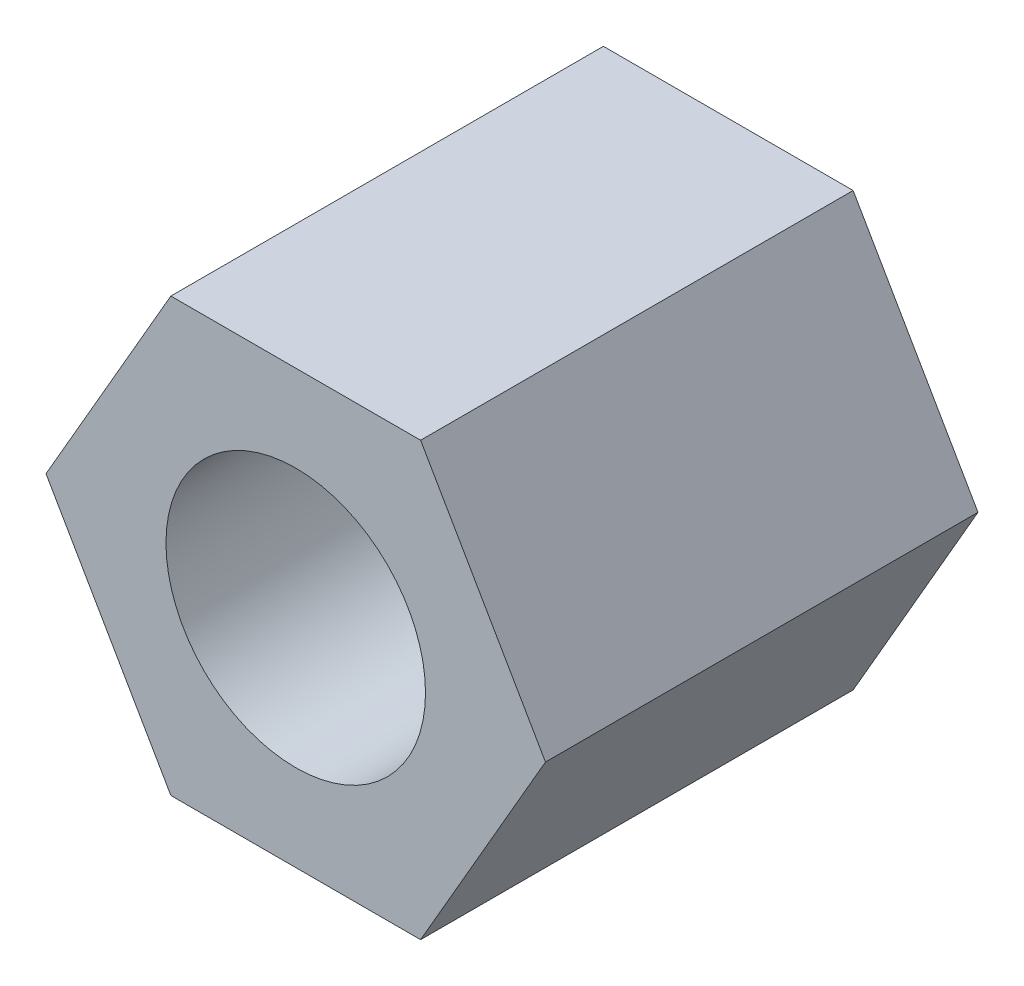
ISO-10303-21;
HEADER;
FILE_DESCRIPTION(('STEP AP214'),'2;1');
FILE_NAME('part.step','',(''),(''),'','','');
FILE_SCHEMA(('AUTOMOTIVE_DESIGN { 1 0 10303 214 1 1 1 1 }'));
ENDSEC;
DATA;
#1=APPLICATION_CONTEXT('core data for automotive mechanical design processes');
#2=APPLICATION_PROTOCOL_DEFINITION('international standard','automotive_design',2000,#1);
#3=PRODUCT_CONTEXT('',#1,'mechanical');
#4=PRODUCT('Part','Part','',(#3));
#5=PRODUCT_RELATED_PRODUCT_CATEGORY('part','',(#4));
#6=PRODUCT_DEFINITION_FORMATION('','',#4);
#7=PRODUCT_DEFINITION_CONTEXT('part definition',#1,'design');
#8=PRODUCT_DEFINITION('design','',#6,#7);
#9=PRODUCT_DEFINITION_SHAPE('','',#8);
#10=(LENGTH_UNIT() NAMED_UNIT(*) SI_UNIT(.MILLI.,.METRE.));
#11=(NAMED_UNIT(*) PLANE_ANGLE_UNIT() SI_UNIT($,.RADIAN.));
#12=(NAMED_UNIT(*) SI_UNIT($,.STERADIAN.) SOLID_ANGLE_UNIT());
#13=UNCERTAINTY_MEASURE_WITH_UNIT(LENGTH_MEASURE(1.E-05),#10,'distance_accuracy_value','');
#14=(GEOMETRIC_REPRESENTATION_CONTEXT(3) GLOBAL_UNCERTAINTY_ASSIGNED_CONTEXT((#13)) GLOBAL_UNIT_ASSIGNED_CONTEXT((#10,
#11,#12)) REPRESENTATION_CONTEXT('',''));
#15=CARTESIAN_POINT('',(0.,0.,0.));
#16=DIRECTION('',(0.,0.,1.));
#17=DIRECTION('',(1.,0.,0.));
#18=AXIS2_PLACEMENT_3D('',#15,#16,#17);
#19=CARTESIAN_POINT('',(0.,0.,5.));
#20=DIRECTION('',(0.,0.,1.));
#21=DIRECTION('',(1.,0.,0.));
#22=AXIS2_PLACEMENT_3D('',#19,#20,#21);
#23=PLANE('',#22);
#24=DIRECTION('',(1.,0.,0.));
#25=VECTOR('',#24,1.);
#26=CARTESIAN_POINT('',(-1.44337567297406,-2.5,5.));
#27=LINE('',#26,#25);
#28=CARTESIAN_POINT('',(-1.44337567297406,-2.5,5.));
#29=VERTEX_POINT('',#28);
#30=CARTESIAN_POINT('',(1.44337567297406,-2.5,5.));
#31=VERTEX_POINT('',#30);
#32=EDGE_CURVE('E131',#29,#31,#27,.T.);
#33=ORIENTED_EDGE('',*,*,#32,.T.);
#34=DIRECTION('',(0.5,0.866025403784439,0.));
#35=VECTOR('',#34,1.);
#36=CARTESIAN_POINT('',(1.44337567297406,-2.5,5.));
#37=LINE('',#36,#35);
#38=CARTESIAN_POINT('',(2.88675134594813,0.,5.));
#39=VERTEX_POINT('',#38);
#40=EDGE_CURVE('E89',#31,#39,#37,.T.);
#41=ORIENTED_EDGE('',*,*,#40,.T.);
#42=DIRECTION('',(-0.5,0.866025403784439,0.));
#43=VECTOR('',#42,1.);
#44=CARTESIAN_POINT('',(2.88675134594813,0.,5.));
#45=LINE('',#44,#43);
#46=CARTESIAN_POINT('',(1.44337567297406,2.5,5.));
#47=VERTEX_POINT('',#46);
#48=EDGE_CURVE('E102',#39,#47,#45,.T.);
#49=ORIENTED_EDGE('',*,*,#48,.T.);
#50=DIRECTION('',(-1.,0.,0.));
#51=VECTOR('',#50,1.);
#52=CARTESIAN_POINT('',(1.44337567297406,2.5,5.));
#53=LINE('',#52,#51);
#54=CARTESIAN_POINT('',(-1.44337567297406,2.5,5.));
#55=VERTEX_POINT('',#54);
#56=EDGE_CURVE('E96',#47,#55,#53,.T.);
#57=ORIENTED_EDGE('',*,*,#56,.T.);
#58=DIRECTION('',(-0.5,-0.866025403784439,0.));
#59=VECTOR('',#58,1.);
#60=CARTESIAN_POINT('',(-1.44337567297406,2.5,5.));
#61=LINE('',#60,#59);
#62=CARTESIAN_POINT('',(-2.88675134594813,0.,5.));
#63=VERTEX_POINT('',#62);
#64=EDGE_CURVE('E100',#55,#63,#61,.T.);
#65=ORIENTED_EDGE('',*,*,#64,.T.);
#66=DIRECTION('',(0.5,-0.866025403784439,0.));
#67=VECTOR('',#66,1.);
#68=CARTESIAN_POINT('',(-2.88675134594813,0.,5.));
#69=LINE('',#68,#67);
#70=EDGE_CURVE('E52',#63,#29,#69,.T.);
#71=ORIENTED_EDGE('',*,*,#70,.T.);
#72=EDGE_LOOP('',(#33,#41,#49,#57,#65,#71));
#73=FACE_BOUND('',#72,.T.);
#74=CARTESIAN_POINT('',(0.,0.,5.));
#75=DIRECTION('',(0.,0.,1.));
#76=DIRECTION('',(1.,0.,0.));
#77=AXIS2_PLACEMENT_3D('',#74,#75,#76);
#78=CIRCLE('',#77,1.5);
#79=CARTESIAN_POINT('',(1.5,0.,5.));
#80=VERTEX_POINT('',#79);
#81=EDGE_CURVE('E124',#80,#80,#78,.T.);
#82=ORIENTED_EDGE('',*,*,#81,.F.);
#83=EDGE_LOOP('',(#82));
#84=FACE_BOUND('',#83,.T.);
#85=ADVANCED_FACE('F35',(#73,#84),#23,.T.);
#86=CARTESIAN_POINT('',(0.,0.,0.));
#87=DIRECTION('',(0.,0.,1.));
#88=DIRECTION('',(1.,0.,0.));
#89=AXIS2_PLACEMENT_3D('',#86,#87,#88);
#90=PLANE('',#89);
#91=DIRECTION('',(1.,0.,0.));
#92=VECTOR('',#91,1.);
#93=CARTESIAN_POINT('',(-1.44337567297406,-2.5,0.));
#94=LINE('',#93,#92);
#95=CARTESIAN_POINT('',(-1.44337567297406,-2.5,0.));
#96=VERTEX_POINT('',#95);
#97=CARTESIAN_POINT('',(1.44337567297406,-2.5,0.));
#98=VERTEX_POINT('',#97);
#99=EDGE_CURVE('E120',#96,#98,#94,.T.);
#100=ORIENTED_EDGE('',*,*,#99,.F.);
#101=DIRECTION('',(0.5,-0.866025403784439,0.));
#102=VECTOR('',#101,1.);
#103=CARTESIAN_POINT('',(-2.88675134594813,0.,0.));
#104=LINE('',#103,#102);
#105=CARTESIAN_POINT('',(-2.88675134594813,0.,0.));
#106=VERTEX_POINT('',#105);
#107=EDGE_CURVE('E81',#106,#96,#104,.T.);
#108=ORIENTED_EDGE('',*,*,#107,.F.);
#109=DIRECTION('',(-0.5,-0.866025403784439,0.));
#110=VECTOR('',#109,1.);
#111=CARTESIAN_POINT('',(-1.44337567297406,2.5,0.));
#112=LINE('',#111,#110);
#113=CARTESIAN_POINT('',(-1.44337567297406,2.5,0.));
#114=VERTEX_POINT('',#113);
#115=EDGE_CURVE('E75',#114,#106,#112,.T.);
#116=ORIENTED_EDGE('',*,*,#115,.F.);
#117=DIRECTION('',(-1.,0.,0.));
#118=VECTOR('',#117,1.);
#119=CARTESIAN_POINT('',(1.44337567297406,2.5,0.));
#120=LINE('',#119,#118);
#121=CARTESIAN_POINT('',(1.44337567297406,2.5,0.));
#122=VERTEX_POINT('',#121);
#123=EDGE_CURVE('E110',#122,#114,#120,.T.);
#124=ORIENTED_EDGE('',*,*,#123,.F.);
#125=DIRECTION('',(-0.5,0.866025403784439,0.));
#126=VECTOR('',#125,1.);
#127=CARTESIAN_POINT('',(2.88675134594813,0.,0.));
#128=LINE('',#127,#126);
#129=CARTESIAN_POINT('',(2.88675134594813,0.,0.));
#130=VERTEX_POINT('',#129);
#131=EDGE_CURVE('E126',#130,#122,#128,.T.);
#132=ORIENTED_EDGE('',*,*,#131,.F.);
#133=DIRECTION('',(0.5,0.866025403784439,0.));
#134=VECTOR('',#133,1.);
#135=CARTESIAN_POINT('',(1.44337567297406,-2.5,0.));
#136=LINE('',#135,#134);
#137=EDGE_CURVE('E123',#98,#130,#136,.T.);
#138=ORIENTED_EDGE('',*,*,#137,.F.);
#139=EDGE_LOOP('',(#100,#108,#116,#124,#132,#138));
#140=FACE_BOUND('',#139,.T.);
#141=CARTESIAN_POINT('',(0.,0.,0.));
#142=DIRECTION('',(0.,0.,1.));
#143=DIRECTION('',(1.,0.,0.));
#144=AXIS2_PLACEMENT_3D('',#141,#142,#143);
#145=CIRCLE('',#144,1.5);
#146=CARTESIAN_POINT('',(1.5,0.,0.));
#147=VERTEX_POINT('',#146);
#148=EDGE_CURVE('E224',#147,#147,#145,.T.);
#149=ORIENTED_EDGE('',*,*,#148,.T.);
#150=EDGE_LOOP('',(#149));
#151=FACE_BOUND('',#150,.T.);
#152=ADVANCED_FACE('F140',(#140,#151),#90,.F.);
#153=CARTESIAN_POINT('',(-1.44337567297406,-2.5,5.));
#154=DIRECTION('',(0.,1.,0.));
#155=DIRECTION('',(-1.,0.,0.));
#156=AXIS2_PLACEMENT_3D('',#153,#154,#155);
#157=PLANE('',#156);
#158=ORIENTED_EDGE('',*,*,#99,.T.);
#159=DIRECTION('',(0.,0.,-1.));
#160=VECTOR('',#159,1.);
#161=CARTESIAN_POINT('',(1.44337567297406,-2.5,5.));
#162=LINE('',#161,#160);
#163=EDGE_CURVE('E11',#31,#98,#162,.T.);
#164=ORIENTED_EDGE('',*,*,#163,.F.);
#165=ORIENTED_EDGE('',*,*,#32,.F.);
#166=DIRECTION('',(0.,0.,-1.));
#167=VECTOR('',#166,1.);
#168=CARTESIAN_POINT('',(-1.44337567297406,-2.5,5.));
#169=LINE('',#168,#167);
#170=EDGE_CURVE('E116',#29,#96,#169,.T.);
#171=ORIENTED_EDGE('',*,*,#170,.T.);
#172=EDGE_LOOP('',(#158,#164,#165,#171));
#173=FACE_BOUND('',#172,.T.);
#174=ADVANCED_FACE('F37',(#173),#157,.F.);
#175=CARTESIAN_POINT('',(1.44337567297406,-2.5,5.));
#176=DIRECTION('',(-0.866025403784439,0.5,0.));
#177=DIRECTION('',(-0.5,-0.866025403784439,0.));
#178=AXIS2_PLACEMENT_3D('',#175,#176,#177);
#179=PLANE('',#178);
#180=ORIENTED_EDGE('',*,*,#137,.T.);
#181=DIRECTION('',(0.,0.,-1.));
#182=VECTOR('',#181,1.);
#183=CARTESIAN_POINT('',(2.88675134594813,0.,5.));
#184=LINE('',#183,#182);
#185=EDGE_CURVE('E44',#39,#130,#184,.T.);
#186=ORIENTED_EDGE('',*,*,#185,.F.);
#187=ORIENTED_EDGE('',*,*,#40,.F.);
#188=ORIENTED_EDGE('',*,*,#163,.T.);
#189=EDGE_LOOP('',(#180,#186,#187,#188));
#190=FACE_BOUND('',#189,.T.);
#191=ADVANCED_FACE('F165',(#190),#179,.F.);
#192=CARTESIAN_POINT('',(2.88675134594813,0.,5.));
#193=DIRECTION('',(-0.866025403784439,-0.5,0.));
#194=DIRECTION('',(0.5,-0.866025403784439,0.));
#195=AXIS2_PLACEMENT_3D('',#192,#193,#194);
#196=PLANE('',#195);
#197=ORIENTED_EDGE('',*,*,#131,.T.);
#198=DIRECTION('',(0.,0.,-1.));
#199=VECTOR('',#198,1.);
#200=CARTESIAN_POINT('',(1.44337567297406,2.5,5.));
#201=LINE('',#200,#199);
#202=EDGE_CURVE('E111',#47,#122,#201,.T.);
#203=ORIENTED_EDGE('',*,*,#202,.F.);
#204=ORIENTED_EDGE('',*,*,#48,.F.);
#205=ORIENTED_EDGE('',*,*,#185,.T.);
#206=EDGE_LOOP('',(#197,#203,#204,#205));
#207=FACE_BOUND('',#206,.T.);
#208=ADVANCED_FACE('F137',(#207),#196,.F.);
#209=CARTESIAN_POINT('',(1.44337567297406,2.5,5.));
#210=DIRECTION('',(0.,-1.,0.));
#211=DIRECTION('',(0.,0.,-1.));
#212=AXIS2_PLACEMENT_3D('',#209,#210,#211);
#213=PLANE('',#212);
#214=ORIENTED_EDGE('',*,*,#123,.T.);
#215=DIRECTION('',(0.,0.,-1.));
#216=VECTOR('',#215,1.);
#217=CARTESIAN_POINT('',(-1.44337567297406,2.5,5.));
#218=LINE('',#217,#216);
#219=EDGE_CURVE('E107',#55,#114,#218,.T.);
#220=ORIENTED_EDGE('',*,*,#219,.F.);
#221=ORIENTED_EDGE('',*,*,#56,.F.);
#222=ORIENTED_EDGE('',*,*,#202,.T.);
#223=EDGE_LOOP('',(#214,#220,#221,#222));
#224=FACE_BOUND('',#223,.T.);
#225=ADVANCED_FACE('F108',(#224),#213,.F.);
#226=CARTESIAN_POINT('',(-1.44337567297406,2.5,5.));
#227=DIRECTION('',(0.866025403784438,-0.5,0.));
#228=DIRECTION('',(0.5,0.866025403784439,0.));
#229=AXIS2_PLACEMENT_3D('',#226,#227,#228);
#230=PLANE('',#229);
#231=ORIENTED_EDGE('',*,*,#115,.T.);
#232=DIRECTION('',(0.,0.,-1.));
#233=VECTOR('',#232,1.);
#234=CARTESIAN_POINT('',(-2.88675134594813,0.,5.));
#235=LINE('',#234,#233);
#236=EDGE_CURVE('E112',#63,#106,#235,.T.);
#237=ORIENTED_EDGE('',*,*,#236,.F.);
#238=ORIENTED_EDGE('',*,*,#64,.F.);
#239=ORIENTED_EDGE('',*,*,#219,.T.);
#240=EDGE_LOOP('',(#231,#237,#238,#239));
#241=FACE_BOUND('',#240,.T.);
#242=ADVANCED_FACE('F114',(#241),#230,.F.);
#243=CARTESIAN_POINT('',(-2.88675134594813,0.,5.));
#244=DIRECTION('',(0.866025403784439,0.5,0.));
#245=DIRECTION('',(-0.5,0.866025403784439,0.));
#246=AXIS2_PLACEMENT_3D('',#243,#244,#245);
#247=PLANE('',#246);
#248=ORIENTED_EDGE('',*,*,#107,.T.);
#249=ORIENTED_EDGE('',*,*,#170,.F.);
#250=ORIENTED_EDGE('',*,*,#70,.F.);
#251=ORIENTED_EDGE('',*,*,#236,.T.);
#252=EDGE_LOOP('',(#248,#249,#250,#251));
#253=FACE_BOUND('',#252,.T.);
#254=ADVANCED_FACE('F145',(#253),#247,.F.);
#255=CARTESIAN_POINT('',(0.,0.,5.));
#256=DIRECTION('',(0.,0.,-1.));
#257=DIRECTION('',(-1.,0.,0.));
#258=AXIS2_PLACEMENT_3D('',#255,#256,#257);
#259=CYLINDRICAL_SURFACE('',#258,1.5);
#260=ORIENTED_EDGE('',*,*,#81,.T.);
#261=EDGE_LOOP('',(#260));
#262=FACE_BOUND('',#261,.T.);
#263=ORIENTED_EDGE('',*,*,#148,.F.);
#264=EDGE_LOOP('',(#263));
#265=FACE_BOUND('',#264,.T.);
#266=ADVANCED_FACE('F147',(#262,#265),#259,.F.);
#267=CLOSED_SHELL('',(#85,#152,#174,#191,#208,#225,#242,#254,#266));
#268=MANIFOLD_SOLID_BREP('B2',#267);
#269=ADVANCED_BREP_SHAPE_REPRESENTATION('',(#18,#268),#14);
#270=SHAPE_DEFINITION_REPRESENTATION(#9,#269);
ENDSEC;
END-ISO-10303-21;
